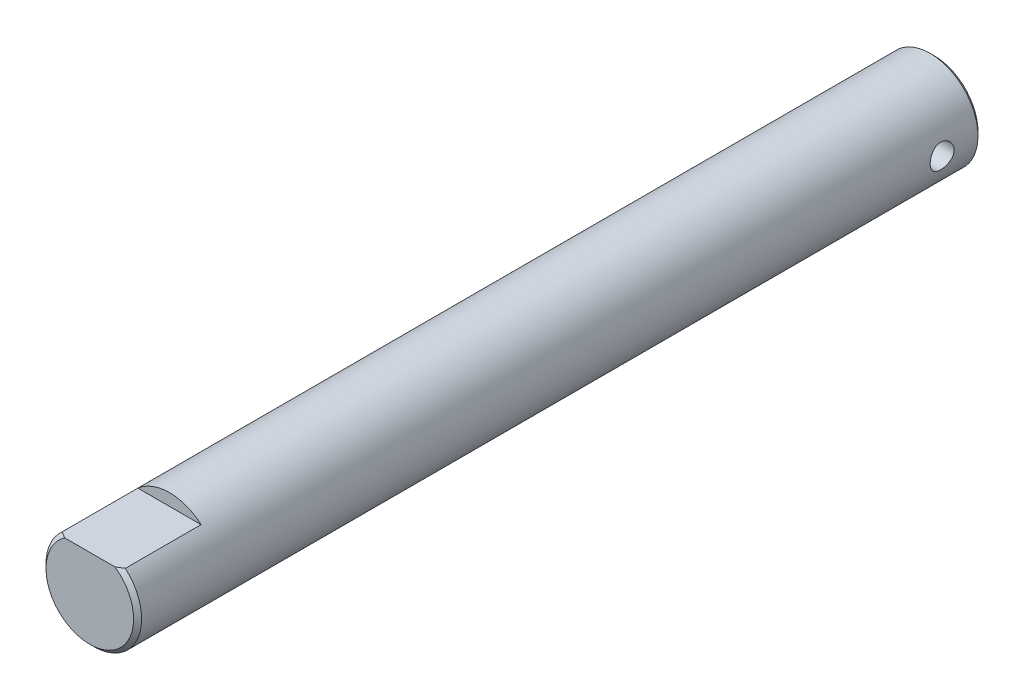
ISO-10303-21;
HEADER;
FILE_DESCRIPTION(('STEP AP214'),'2;1');
FILE_NAME('part.step','',(''),(''),'','','');
FILE_SCHEMA(('AUTOMOTIVE_DESIGN { 1 0 10303 214 1 1 1 1 }'));
ENDSEC;
DATA;
#1=APPLICATION_CONTEXT('core data for automotive mechanical design processes');
#2=APPLICATION_PROTOCOL_DEFINITION('international standard','automotive_design',2000,#1);
#3=PRODUCT_CONTEXT('',#1,'mechanical');
#4=PRODUCT('Part','Part','',(#3));
#5=PRODUCT_RELATED_PRODUCT_CATEGORY('part','',(#4));
#6=PRODUCT_DEFINITION_FORMATION('','',#4);
#7=PRODUCT_DEFINITION_CONTEXT('part definition',#1,'design');
#8=PRODUCT_DEFINITION('design','',#6,#7);
#9=PRODUCT_DEFINITION_SHAPE('','',#8);
#10=(LENGTH_UNIT() NAMED_UNIT(*) SI_UNIT(.MILLI.,.METRE.));
#11=(NAMED_UNIT(*) PLANE_ANGLE_UNIT() SI_UNIT($,.RADIAN.));
#12=(NAMED_UNIT(*) SI_UNIT($,.STERADIAN.) SOLID_ANGLE_UNIT());
#13=UNCERTAINTY_MEASURE_WITH_UNIT(LENGTH_MEASURE(1.E-05),#10,'distance_accuracy_value','');
#14=(GEOMETRIC_REPRESENTATION_CONTEXT(3) GLOBAL_UNCERTAINTY_ASSIGNED_CONTEXT((#13)) GLOBAL_UNIT_ASSIGNED_CONTEXT((#10,
#11,#12)) REPRESENTATION_CONTEXT('',''));
#15=CARTESIAN_POINT('',(0.,0.,0.));
#16=DIRECTION('',(0.,0.,1.));
#17=DIRECTION('',(1.,0.,0.));
#18=AXIS2_PLACEMENT_3D('',#15,#16,#17);
#19=CARTESIAN_POINT('',(0.,0.,53.));
#20=DIRECTION('',(0.,0.,-1.));
#21=DIRECTION('',(-1.,0.,0.));
#22=AXIS2_PLACEMENT_3D('',#19,#20,#21);
#23=CYLINDRICAL_SURFACE('',#22,6.);
#24=CARTESIAN_POINT('',(0.,0.,52.5));
#25=DIRECTION('',(0.,0.,1.));
#26=DIRECTION('',(1.,0.,0.));
#27=AXIS2_PLACEMENT_3D('',#24,#25,#26);
#28=CIRCLE('',#27,6.);
#29=CARTESIAN_POINT('',(3.96862696659689,4.5,52.5));
#30=VERTEX_POINT('',#29);
#31=CARTESIAN_POINT('',(-3.96862696659689,4.5,52.5));
#32=VERTEX_POINT('',#31);
#33=EDGE_CURVE('E105',#30,#32,#28,.F.);
#34=ORIENTED_EDGE('',*,*,#33,.T.);
#35=DIRECTION('',(0.,0.,1.));
#36=VECTOR('',#35,1.);
#37=CARTESIAN_POINT('',(-3.96862696659689,4.5,43.));
#38=LINE('',#37,#36);
#39=CARTESIAN_POINT('',(-3.96862696659689,4.5,43.));
#40=VERTEX_POINT('',#39);
#41=EDGE_CURVE('E97',#40,#32,#38,.T.);
#42=ORIENTED_EDGE('',*,*,#41,.F.);
#43=CARTESIAN_POINT('',(0.,0.,43.));
#44=DIRECTION('',(0.,0.,1.));
#45=DIRECTION('',(1.,0.,0.));
#46=AXIS2_PLACEMENT_3D('',#43,#44,#45);
#47=CIRCLE('',#46,6.);
#48=CARTESIAN_POINT('',(3.96862696659689,4.5,43.));
#49=VERTEX_POINT('',#48);
#50=EDGE_CURVE('E88',#49,#40,#47,.T.);
#51=ORIENTED_EDGE('',*,*,#50,.F.);
#52=DIRECTION('',(0.,0.,1.));
#53=VECTOR('',#52,1.);
#54=CARTESIAN_POINT('',(3.96862696659689,4.5,43.));
#55=LINE('',#54,#53);
#56=EDGE_CURVE('E99',#49,#30,#55,.T.);
#57=ORIENTED_EDGE('',*,*,#56,.T.);
#58=EDGE_LOOP('',(#34,#42,#51,#57));
#59=FACE_BOUND('',#58,.T.);
#60=CARTESIAN_POINT('',(0.,0.,-52.5));
#61=DIRECTION('',(0.,0.,1.));
#62=DIRECTION('',(1.,0.,0.));
#63=AXIS2_PLACEMENT_3D('',#60,#61,#62);
#64=CIRCLE('',#63,6.);
#65=CARTESIAN_POINT('',(6.,0.,-52.5));
#66=VERTEX_POINT('',#65);
#67=EDGE_CURVE('E168',#66,#66,#64,.T.);
#68=ORIENTED_EDGE('',*,*,#67,.T.);
#69=EDGE_LOOP('',(#68));
#70=FACE_BOUND('',#69,.T.);
#71=CARTESIAN_POINT('',(6.,0.,-46.5));
#72=CARTESIAN_POINT('',(5.99999859868013,0.0828760886697312,-46.5000023257382));
#73=CARTESIAN_POINT('',(5.99826578131828,0.165778157830763,-46.5068915507738));
#74=CARTESIAN_POINT('',(5.99152113829892,0.329206323770533,-46.534225151307));
#75=CARTESIAN_POINT('',(5.98650745419968,0.40973104687074,-46.5546772095379));
#76=CARTESIAN_POINT('',(5.9737562633204,0.566020872182577,-46.6084392534621));
#77=CARTESIAN_POINT('',(5.96602202842087,0.641791563430002,-46.6417337987153));
#78=CARTESIAN_POINT('',(5.94865343807593,0.786672131904427,-46.7201813900448));
#79=CARTESIAN_POINT('',(5.9390190185405,0.855781784348762,-46.7653348361189));
#80=CARTESIAN_POINT('',(5.91867413591801,0.986801927300924,-46.8672007896542));
#81=CARTESIAN_POINT('',(5.90794707148533,1.04855569006108,-46.9241115749592));
#82=CARTESIAN_POINT('',(5.8867362011753,1.16174892720331,-47.0474522049089));
#83=CARTESIAN_POINT('',(5.87625242288348,1.21318723694914,-47.1138831229465));
#84=CARTESIAN_POINT('',(5.8565477569971,1.30502654279904,-47.2555952267374));
#85=CARTESIAN_POINT('',(5.84734794470605,1.34525221592536,-47.3309932308104));
#86=CARTESIAN_POINT('',(5.83149494812223,1.41239690855053,-47.4877484116584));
#87=CARTESIAN_POINT('',(5.82484135672789,1.43931805543934,-47.5691046333258));
#88=CARTESIAN_POINT('',(5.81500476717551,1.47855483680429,-47.7337434982025));
#89=CARTESIAN_POINT('',(5.81175491075426,1.49115226833334,-47.8169548960498));
#90=CARTESIAN_POINT('',(5.80889362537741,1.50226177506786,-47.984368569014));
#91=CARTESIAN_POINT('',(5.80928160448644,1.50077614181798,-48.0685706806986));
#92=CARTESIAN_POINT('',(5.81359205496618,1.48398652463928,-48.2334158077445));
#93=CARTESIAN_POINT('',(5.81742863001879,1.46901834019052,-48.3140956214651));
#94=CARTESIAN_POINT('',(5.82806709676484,1.42622418690311,-48.4717610509113));
#95=CARTESIAN_POINT('',(5.83486919970696,1.39839730206943,-48.548746403029));
#96=CARTESIAN_POINT('',(5.85075113904186,1.33038947793716,-48.6977380162521));
#97=CARTESIAN_POINT('',(5.85985327469421,1.29008666723292,-48.7696861717895));
#98=CARTESIAN_POINT('',(5.87929710846386,1.19835627601496,-48.9059187097568));
#99=CARTESIAN_POINT('',(5.88963902334735,1.14692674880884,-48.9702017480673));
#100=CARTESIAN_POINT('',(5.91075880539781,1.03266342468122,-49.0912036156944));
#101=CARTESIAN_POINT('',(5.92154069477971,0.969546258165861,-49.1476544900613));
#102=CARTESIAN_POINT('',(5.94205965578786,0.834611917503703,-49.2492212424639));
#103=CARTESIAN_POINT('',(5.95179669549415,0.762794477707949,-49.2943367742636));
#104=CARTESIAN_POINT('',(5.96917732094182,0.612115888681399,-49.3720505862244));
#105=CARTESIAN_POINT('',(5.97681360127725,0.53323139320863,-49.4046053402544));
#106=CARTESIAN_POINT('',(5.98907916991419,0.370876008142888,-49.4559173057096));
#107=CARTESIAN_POINT('',(5.99370903339281,0.287405999150488,-49.4746771564181));
#108=CARTESIAN_POINT('',(5.99935499271375,0.120539970390028,-49.4974575655588));
#109=CARTESIAN_POINT('',(6.00046053508279,0.0371967199882107,-49.5018430260753));
#110=CARTESIAN_POINT('',(5.99918804814451,-0.129032874801508,-49.4967509979445));
#111=CARTESIAN_POINT('',(5.99681033241847,-0.211919259644594,-49.4872747572009));
#112=CARTESIAN_POINT('',(5.98889581127357,-0.373614268776492,-49.4550290916086));
#113=CARTESIAN_POINT('',(5.98340634185811,-0.452465118968755,-49.432458736523));
#114=CARTESIAN_POINT('',(5.96988706634134,-0.605257292452512,-49.3748929159716));
#115=CARTESIAN_POINT('',(5.96185700369892,-0.679198119032636,-49.3398961956868));
#116=CARTESIAN_POINT('',(5.9439330792631,-0.821523134429848,-49.2577638711253));
#117=CARTESIAN_POINT('',(5.93400867366932,-0.889785441835831,-49.2104238876032));
#118=CARTESIAN_POINT('',(5.91344509187419,-1.01752661364325,-49.105210091203));
#119=CARTESIAN_POINT('',(5.90280579251705,-1.07700395897301,-49.0473344603831));
#120=CARTESIAN_POINT('',(5.88168956960771,-1.18699056807274,-48.9209980391555));
#121=CARTESIAN_POINT('',(5.87122304187281,-1.23724386762204,-48.8523122969976));
#122=CARTESIAN_POINT('',(5.85192878377239,-1.3255107590127,-48.7072673655343));
#123=CARTESIAN_POINT('',(5.84310098067026,-1.36352489415794,-48.6309085170402));
#124=CARTESIAN_POINT('',(5.82818094734665,-1.4259514206093,-48.4730942775869));
#125=CARTESIAN_POINT('',(5.82207255291906,-1.45044439665407,-48.391672371656));
#126=CARTESIAN_POINT('',(5.81326744090183,-1.48534565995378,-48.2256903621109));
#127=CARTESIAN_POINT('',(5.81056997719936,-1.49575702747866,-48.1411309489675));
#128=CARTESIAN_POINT('',(5.80894901203957,-1.502038590334,-47.9738789761448));
#129=CARTESIAN_POINT('',(5.80991932728264,-1.49831789778012,-47.8912025648753));
#130=CARTESIAN_POINT('',(5.81527909007843,-1.47737727831287,-47.727696111332));
#131=CARTESIAN_POINT('',(5.81966846891857,-1.46015762268677,-47.6468660319864));
#132=CARTESIAN_POINT('',(5.83131260682722,-1.4129313194428,-47.4897915409346));
#133=CARTESIAN_POINT('',(5.83855015236309,-1.38300140468038,-47.4135226947598));
#134=CARTESIAN_POINT('',(5.85507755724828,-1.31126491360508,-47.2670346172863));
#135=CARTESIAN_POINT('',(5.86436770120773,-1.26945669003419,-47.1968162268131));
#136=CARTESIAN_POINT('',(5.88425634263512,-1.17386774863714,-47.062445370998));
#137=CARTESIAN_POINT('',(5.89488264831757,-1.11980316291226,-46.998498926576));
#138=CARTESIAN_POINT('',(5.91608027246286,-1.00178937118974,-46.8804529552046));
#139=CARTESIAN_POINT('',(5.9266515772706,-0.937837821261149,-46.826355769887));
#140=CARTESIAN_POINT('',(5.94677655647663,-0.80046758670259,-46.7285886914354));
#141=CARTESIAN_POINT('',(5.95630833365868,-0.726898422316386,-46.6851253863284));
#142=CARTESIAN_POINT('',(5.97304924975118,-0.573266059510476,-46.6112525370595));
#143=CARTESIAN_POINT('',(5.98026005199781,-0.493207563436741,-46.5808336393515));
#144=CARTESIAN_POINT('',(5.99048059565542,-0.344410253243474,-46.5384281696703));
#145=CARTESIAN_POINT('',(5.99402585052691,-0.27638017090807,-46.5240487569466));
#146=CARTESIAN_POINT('',(5.99878605231948,-0.138906071536284,-46.5048340563781));
#147=CARTESIAN_POINT('',(6.00000117450894,-0.0694621612426168,-46.4999980506947));
#148=CARTESIAN_POINT('',(6.,0.,-46.5));
#149=B_SPLINE_CURVE_WITH_KNOTS('',3,(#71,#72,#73,#74,#75,#76,#77,#78,#79,#80,#81,#82,#83,#84,
#85,#86,#87,#88,#89,#90,#91,#92,#93,#94,#95,#96,#97,#98,#99,#100,#101,#102,#103,#104,#105,#106,
#107,#108,#109,#110,#111,#112,#113,#114,#115,#116,#117,#118,#119,#120,#121,#122,#123,#124,#125,
#126,#127,#128,#129,#130,#131,#132,#133,#134,#135,#136,#137,#138,#139,#140,#141,#142,#143,#144,
#145,#146,#147,#148),.UNSPECIFIED.,.T.,.F.,(4,2,2,2,2,2,2,2,2,2,2,2,2,2,2,2,2,2,2,2,2,2,2,2,2,2,
2,2,2,2,2,2,2,2,2,2,2,2,4),(0.,0.24837371247189,0.496888237763901,0.745104902286104,
0.99332994016933,1.24614435437139,1.49898729580062,1.75558647545808,2.01214461169369,
2.2635629509943,2.51494038112697,2.76022497007018,3.00552703466038,3.25330527873879,
3.50112690836164,3.7560150096902,4.01091089558247,4.26668229009114,4.52240473688644,
4.77158308949277,5.02073901112744,5.26620274514038,5.51169127322291,5.76153587565353,
6.0114236300802,6.26744509204478,6.5234551874951,6.77792254614039,7.0323342325241,
7.27943780398614,7.52653640956036,7.77216400559449,8.01782568136902,8.26989576409912,
8.5220256977042,8.7787218549959,9.03523363821352,9.24342242942151,9.45159556043042),.UNSPECIFIED.);
#150=CARTESIAN_POINT('',(6.,0.,-46.5));
#151=VERTEX_POINT('',#150);
#152=EDGE_CURVE('E123',#151,#151,#149,.T.);
#153=ORIENTED_EDGE('',*,*,#152,.T.);
#154=EDGE_LOOP('',(#153));
#155=FACE_BOUND('',#154,.T.);
#156=CARTESIAN_POINT('',(-6.,0.,-49.5));
#157=CARTESIAN_POINT('',(-5.99999859868013,-0.0828760886697312,-49.4999976742618));
#158=CARTESIAN_POINT('',(-5.99826578131828,-0.165778157830763,-49.4931084492262));
#159=CARTESIAN_POINT('',(-5.99152113829892,-0.329206323770533,-49.465774848693));
#160=CARTESIAN_POINT('',(-5.98650745419968,-0.40973104687074,-49.4453227904622));
#161=CARTESIAN_POINT('',(-5.9737562633204,-0.566020872182577,-49.3915607465379));
#162=CARTESIAN_POINT('',(-5.96602202842087,-0.641791563430002,-49.3582662012847));
#163=CARTESIAN_POINT('',(-5.94865343807593,-0.786672131904427,-49.2798186099552));
#164=CARTESIAN_POINT('',(-5.9390190185405,-0.855781784348761,-49.2346651638811));
#165=CARTESIAN_POINT('',(-5.91867413591801,-0.986801927300925,-49.1327992103458));
#166=CARTESIAN_POINT('',(-5.90794707148533,-1.04855569006108,-49.0758884250408));
#167=CARTESIAN_POINT('',(-5.88673620117529,-1.16174892720331,-48.9525477950911));
#168=CARTESIAN_POINT('',(-5.87625242288348,-1.21318723694914,-48.8861168770535));
#169=CARTESIAN_POINT('',(-5.8565477569971,-1.30502654279904,-48.7444047732626));
#170=CARTESIAN_POINT('',(-5.84734794470605,-1.34525221592536,-48.6690067691896));
#171=CARTESIAN_POINT('',(-5.83149494812223,-1.41239690855053,-48.5122515883416));
#172=CARTESIAN_POINT('',(-5.82484135672789,-1.43931805543934,-48.4308953666742));
#173=CARTESIAN_POINT('',(-5.81500476717551,-1.47855483680429,-48.2662565017975));
#174=CARTESIAN_POINT('',(-5.81175491075426,-1.49115226833334,-48.1830451039502));
#175=CARTESIAN_POINT('',(-5.80889362537741,-1.50226177506786,-48.015631430986));
#176=CARTESIAN_POINT('',(-5.80928160448644,-1.50077614181798,-47.9314293193014));
#177=CARTESIAN_POINT('',(-5.81359205496618,-1.48398652463928,-47.7665841922555));
#178=CARTESIAN_POINT('',(-5.81742863001879,-1.46901834019052,-47.6859043785349));
#179=CARTESIAN_POINT('',(-5.82806709676484,-1.42622418690311,-47.5282389490887));
#180=CARTESIAN_POINT('',(-5.83486919970696,-1.39839730206943,-47.451253596971));
#181=CARTESIAN_POINT('',(-5.85075113904186,-1.33038947793716,-47.3022619837479));
#182=CARTESIAN_POINT('',(-5.85985327469421,-1.29008666723292,-47.2303138282105));
#183=CARTESIAN_POINT('',(-5.87929710846386,-1.19835627601496,-47.0940812902432));
#184=CARTESIAN_POINT('',(-5.88963902334735,-1.14692674880884,-47.0297982519327));
#185=CARTESIAN_POINT('',(-5.91075880539781,-1.03266342468122,-46.9087963843056));
#186=CARTESIAN_POINT('',(-5.92154069477971,-0.969546258165861,-46.8523455099387));
#187=CARTESIAN_POINT('',(-5.94205965578786,-0.834611917503703,-46.7507787575361));
#188=CARTESIAN_POINT('',(-5.95179669549415,-0.762794477707949,-46.7056632257364));
#189=CARTESIAN_POINT('',(-5.96917732094182,-0.612115888681399,-46.6279494137756));
#190=CARTESIAN_POINT('',(-5.97681360127725,-0.53323139320863,-46.5953946597456));
#191=CARTESIAN_POINT('',(-5.98907916991419,-0.370876008142888,-46.5440826942904));
#192=CARTESIAN_POINT('',(-5.99370903339281,-0.287405999150488,-46.5253228435819));
#193=CARTESIAN_POINT('',(-5.99935499271375,-0.120539970390028,-46.5025424344412));
#194=CARTESIAN_POINT('',(-6.00046053508279,-0.0371967199882107,-46.4981569739247));
#195=CARTESIAN_POINT('',(-5.99918804814451,0.129032874801507,-46.5032490020555));
#196=CARTESIAN_POINT('',(-5.99681033241847,0.211919259644594,-46.5127252427991));
#197=CARTESIAN_POINT('',(-5.98889581127357,0.373614268776493,-46.5449709083914));
#198=CARTESIAN_POINT('',(-5.98340634185811,0.452465118968757,-46.567541263477));
#199=CARTESIAN_POINT('',(-5.96988706634134,0.605257292452514,-46.6251070840284));
#200=CARTESIAN_POINT('',(-5.96185700369892,0.679198119032636,-46.6601038043132));
#201=CARTESIAN_POINT('',(-5.9439330792631,0.821523134429848,-46.7422361288747));
#202=CARTESIAN_POINT('',(-5.93400867366932,0.889785441835831,-46.7895761123968));
#203=CARTESIAN_POINT('',(-5.91344509187419,1.01752661364325,-46.894789908797));
#204=CARTESIAN_POINT('',(-5.90280579251705,1.07700395897301,-46.9526655396169));
#205=CARTESIAN_POINT('',(-5.88168956960771,1.18699056807273,-47.0790019608445));
#206=CARTESIAN_POINT('',(-5.87122304187281,1.23724386762204,-47.1476877030024));
#207=CARTESIAN_POINT('',(-5.85192878377239,1.3255107590127,-47.2927326344657));
#208=CARTESIAN_POINT('',(-5.84310098067026,1.36352489415794,-47.3690914829598));
#209=CARTESIAN_POINT('',(-5.82818094734665,1.4259514206093,-47.5269057224131));
#210=CARTESIAN_POINT('',(-5.82207255291906,1.45044439665407,-47.608327628344));
#211=CARTESIAN_POINT('',(-5.81326744090183,1.48534565995378,-47.7743096378891));
#212=CARTESIAN_POINT('',(-5.81056997719936,1.49575702747866,-47.8588690510325));
#213=CARTESIAN_POINT('',(-5.80894901203957,1.502038590334,-48.0261210238552));
#214=CARTESIAN_POINT('',(-5.80991932728264,1.49831789778012,-48.1087974351247));
#215=CARTESIAN_POINT('',(-5.81527909007843,1.47737727831287,-48.272303888668));
#216=CARTESIAN_POINT('',(-5.81966846891857,1.46015762268677,-48.3531339680137));
#217=CARTESIAN_POINT('',(-5.83131260682722,1.4129313194428,-48.5102084590654));
#218=CARTESIAN_POINT('',(-5.83855015236309,1.38300140468038,-48.5864773052402));
#219=CARTESIAN_POINT('',(-5.85507755724828,1.31126491360508,-48.7329653827137));
#220=CARTESIAN_POINT('',(-5.86436770120773,1.26945669003419,-48.8031837731869));
#221=CARTESIAN_POINT('',(-5.88425634263512,1.17386774863714,-48.937554629002));
#222=CARTESIAN_POINT('',(-5.89488264831757,1.11980316291226,-49.001501073424));
#223=CARTESIAN_POINT('',(-5.91608027246286,1.00178937118974,-49.1195470447954));
#224=CARTESIAN_POINT('',(-5.9266515772706,0.937837821261149,-49.173644230113));
#225=CARTESIAN_POINT('',(-5.94677655647663,0.80046758670259,-49.2714113085646));
#226=CARTESIAN_POINT('',(-5.95630833365868,0.726898422316386,-49.3148746136716));
#227=CARTESIAN_POINT('',(-5.97304924975118,0.573266059510476,-49.3887474629405));
#228=CARTESIAN_POINT('',(-5.98026005199781,0.493207563436741,-49.4191663606485));
#229=CARTESIAN_POINT('',(-5.99048059565542,0.344410253243474,-49.4615718303297));
#230=CARTESIAN_POINT('',(-5.99402585052691,0.27638017090807,-49.4759512430534));
#231=CARTESIAN_POINT('',(-5.99878605231948,0.138906071536284,-49.4951659436219));
#232=CARTESIAN_POINT('',(-6.00000117450894,0.0694621612426168,-49.5000019493053));
#233=CARTESIAN_POINT('',(-6.,0.,-49.5));
#234=B_SPLINE_CURVE_WITH_KNOTS('',3,(#156,#157,#158,#159,#160,#161,#162,#163,#164,#165,#166,
#167,#168,#169,#170,#171,#172,#173,#174,#175,#176,#177,#178,#179,#180,#181,#182,#183,#184,#185,
#186,#187,#188,#189,#190,#191,#192,#193,#194,#195,#196,#197,#198,#199,#200,#201,#202,#203,#204,
#205,#206,#207,#208,#209,#210,#211,#212,#213,#214,#215,#216,#217,#218,#219,#220,#221,#222,#223,
#224,#225,#226,#227,#228,#229,#230,#231,#232,#233),.UNSPECIFIED.,.T.,.F.,(4,2,2,2,2,2,2,2,2,2,2,
2,2,2,2,2,2,2,2,2,2,2,2,2,2,2,2,2,2,2,2,2,2,2,2,2,2,2,4),(0.,0.24837371247189,0.496888237763901,
0.745104902286104,0.99332994016933,1.2461443543714,1.49898729580062,1.75558647545807,
2.01214461169369,2.2635629509943,2.51494038112697,2.76022497007018,3.00552703466038,
3.25330527873879,3.50112690836164,3.7560150096902,4.01091089558247,4.26668229009114,
4.52240473688644,4.77158308949277,5.02073901112744,5.26620274514039,5.51169127322292,
5.76153587565353,6.0114236300802,6.26744509204477,6.5234551874951,6.77792254614039,
7.0323342325241,7.27943780398614,7.52653640956036,7.77216400559449,8.01782568136903,
8.26989576409912,8.5220256977042,8.7787218549959,9.03523363821352,9.24342242942151,
9.45159556043042),.UNSPECIFIED.);
#235=CARTESIAN_POINT('',(-6.,0.,-49.5));
#236=VERTEX_POINT('',#235);
#237=EDGE_CURVE('E111',#236,#236,#234,.T.);
#238=ORIENTED_EDGE('',*,*,#237,.F.);
#239=EDGE_LOOP('',(#238));
#240=FACE_BOUND('',#239,.T.);
#241=ADVANCED_FACE('F49',(#59,#70,#155,#240),#23,.T.);
#242=CARTESIAN_POINT('',(0.,0.,53.));
#243=DIRECTION('',(0.,0.,1.));
#244=DIRECTION('',(1.,0.,0.));
#245=AXIS2_PLACEMENT_3D('',#242,#243,#244);
#246=PLANE('',#245);
#247=DIRECTION('',(1.,0.,0.));
#248=VECTOR('',#247,1.);
#249=CARTESIAN_POINT('',(-3.96862696659689,4.5,53.));
#250=LINE('',#249,#248);
#251=CARTESIAN_POINT('',(-3.16227766016844,4.5,53.));
#252=VERTEX_POINT('',#251);
#253=CARTESIAN_POINT('',(3.16227766016844,4.5,53.));
#254=VERTEX_POINT('',#253);
#255=EDGE_CURVE('E71',#252,#254,#250,.T.);
#256=ORIENTED_EDGE('',*,*,#255,.F.);
#257=CARTESIAN_POINT('',(0.,0.,53.));
#258=DIRECTION('',(0.,0.,1.));
#259=DIRECTION('',(1.,0.,0.));
#260=AXIS2_PLACEMENT_3D('',#257,#258,#259);
#261=CIRCLE('',#260,5.50000000000003);
#262=EDGE_CURVE('E175',#252,#254,#261,.T.);
#263=ORIENTED_EDGE('',*,*,#262,.T.);
#264=EDGE_LOOP('',(#256,#263));
#265=FACE_BOUND('',#264,.T.);
#266=ADVANCED_FACE('F139',(#265),#246,.T.);
#267=CARTESIAN_POINT('',(0.,0.,-53.));
#268=DIRECTION('',(0.,0.,1.));
#269=DIRECTION('',(1.,0.,0.));
#270=AXIS2_PLACEMENT_3D('',#267,#268,#269);
#271=PLANE('',#270);
#272=CARTESIAN_POINT('',(0.,0.,-53.));
#273=DIRECTION('',(0.,0.,1.));
#274=DIRECTION('',(1.,0.,0.));
#275=AXIS2_PLACEMENT_3D('',#272,#273,#274);
#276=CIRCLE('',#275,5.50000000000003);
#277=CARTESIAN_POINT('',(5.50000000000003,0.,-53.));
#278=VERTEX_POINT('',#277);
#279=EDGE_CURVE('E165',#278,#278,#276,.F.);
#280=ORIENTED_EDGE('',*,*,#279,.T.);
#281=EDGE_LOOP('',(#280));
#282=FACE_BOUND('',#281,.T.);
#283=ADVANCED_FACE('F145',(#282),#271,.F.);
#284=CARTESIAN_POINT('',(6.001,0.,-48.));
#285=DIRECTION('',(-1.,0.,0.));
#286=DIRECTION('',(0.,0.,1.));
#287=AXIS2_PLACEMENT_3D('',#284,#285,#286);
#288=CYLINDRICAL_SURFACE('',#287,1.5);
#289=ORIENTED_EDGE('',*,*,#152,.F.);
#290=EDGE_LOOP('',(#289));
#291=FACE_BOUND('',#290,.T.);
#292=ORIENTED_EDGE('',*,*,#237,.T.);
#293=EDGE_LOOP('',(#292));
#294=FACE_BOUND('',#293,.T.);
#295=ADVANCED_FACE('F153',(#291,#294),#288,.F.);
#296=CARTESIAN_POINT('',(0.,0.,-52.5));
#297=DIRECTION('',(0.,0.,1.));
#298=DIRECTION('',(1.,0.,0.));
#299=AXIS2_PLACEMENT_3D('',#296,#297,#298);
#300=CONICAL_SURFACE('',#299,6.,0.785398163397444);
#301=ORIENTED_EDGE('',*,*,#279,.F.);
#302=EDGE_LOOP('',(#301));
#303=FACE_BOUND('',#302,.T.);
#304=ORIENTED_EDGE('',*,*,#67,.F.);
#305=EDGE_LOOP('',(#304));
#306=FACE_BOUND('',#305,.T.);
#307=ADVANCED_FACE('F150',(#303,#306),#300,.T.);
#308=CARTESIAN_POINT('',(0.,0.,53.));
#309=DIRECTION('',(0.,0.,-1.));
#310=DIRECTION('',(-1.,0.,0.));
#311=AXIS2_PLACEMENT_3D('',#308,#309,#310);
#312=CONICAL_SURFACE('',#311,5.50000000000003,0.785398163397451);
#313=CARTESIAN_POINT('',(-3.96932696659689,4.5,52.4995369705536));
#314=CARTESIAN_POINT('',(-3.87304468080124,4.5,52.5632169643785));
#315=CARTESIAN_POINT('',(-3.77616677963268,4.5,52.6260093176112));
#316=CARTESIAN_POINT('',(-3.58105421371582,4.5,52.7495035658277));
#317=CARTESIAN_POINT('',(-3.48281920638923,4.5,52.8102049189476));
#318=CARTESIAN_POINT('',(-3.28435670942016,4.5,52.9294811534401));
#319=CARTESIAN_POINT('',(-3.18412146711252,4.5,52.988043198516));
#320=CARTESIAN_POINT('',(-2.98202395687161,4.5,53.1022661831645));
#321=CARTESIAN_POINT('',(-2.88016179697021,4.5,53.1579273143281));
#322=CARTESIAN_POINT('',(-2.56593845022974,4.5,53.3229788135237));
#323=CARTESIAN_POINT('',(-2.35065762326782,4.5,53.4269294681436));
#324=CARTESIAN_POINT('',(-1.91178963009906,4.5,53.6147345338982));
#325=CARTESIAN_POINT('',(-1.6882215131673,4.5,53.6986320873114));
#326=CARTESIAN_POINT('',(-1.32675449953204,4.5,53.810211211472));
#327=CARTESIAN_POINT('',(-1.19160817038663,4.5,53.8467996394164));
#328=CARTESIAN_POINT('',(-0.918779289775629,4.5,53.9090814068741));
#329=CARTESIAN_POINT('',(-0.781096659649087,4.5,53.9347744078806));
#330=CARTESIAN_POINT('',(-0.505636653206499,4.5,53.9737086872283));
#331=CARTESIAN_POINT('',(-0.367880082452009,4.5,53.987095136308));
#332=CARTESIAN_POINT('',(-0.0917179384168567,4.5,54.0011774854638));
#333=CARTESIAN_POINT('',(0.0466875864947491,4.5,54.0018743167663));
#334=CARTESIAN_POINT('',(0.323056405426837,4.5,53.9905338516377));
#335=CARTESIAN_POINT('',(0.461019356248075,4.5,53.9784883336063));
#336=CARTESIAN_POINT('',(0.73534682252479,4.5,53.9423436411936));
#337=CARTESIAN_POINT('',(0.871711150880722,4.5,53.9182430700466));
#338=CARTESIAN_POINT('',(1.14363504409316,4.5,53.8588713990268));
#339=CARTESIAN_POINT('',(1.27916627855488,4.5,53.8234722469224));
#340=CARTESIAN_POINT('',(1.54732673165483,4.5,53.7431263126755));
#341=CARTESIAN_POINT('',(1.67995595792776,4.5,53.6981795556544));
#342=CARTESIAN_POINT('',(2.00503677734374,4.5,53.5768140068095));
#343=CARTESIAN_POINT('',(2.19570476391982,4.5,53.4956341074673));
#344=CARTESIAN_POINT('',(2.57094921629759,4.5,53.3200156387838));
#345=CARTESIAN_POINT('',(2.75551893256847,4.5,53.225562948819));
#346=CARTESIAN_POINT('',(3.11423723719973,4.5,53.0294838372625));
#347=CARTESIAN_POINT('',(3.28853277390238,4.5,52.9281239999135));
#348=CARTESIAN_POINT('',(3.54644873116852,4.5,52.7708911221641));
#349=CARTESIAN_POINT('',(3.63171950801598,4.5,52.7176903310002));
#350=CARTESIAN_POINT('',(3.80125224186777,4.5,52.6097320174959));
#351=CARTESIAN_POINT('',(3.88551435188692,4.5,52.5549747356396));
#352=CARTESIAN_POINT('',(3.96932696659689,4.5,52.4995369705536));
#353=B_SPLINE_CURVE_WITH_KNOTS('',3,(#313,#314,#315,#316,#317,#318,#319,#320,#321,#322,#323,
#324,#325,#326,#327,#328,#329,#330,#331,#332,#333,#334,#335,#336,#337,#338,#339,#340,#341,#342,
#343,#344,#345,#346,#347,#348,#349,#350,#351,#352),.UNSPECIFIED.,.F.,.F.,(4,2,2,2,2,2,2,2,2,2,2,
2,2,2,2,2,2,2,2,4),(0.,0.346312506603484,0.692714092030101,1.0409341904005,1.38913126133352,
2.10561305354154,2.82053924421131,3.24019972386057,3.65987324086364,4.07453018176245,
4.48915669297621,4.9040508921707,5.31899317446166,5.7388159553488,6.15863763161769,
6.77960344379939,7.4012349607494,8.00587846175204,8.30738313541652,8.60884147591047),.UNSPECIFIED.);
#354=EDGE_CURVE('E11',#32,#252,#353,.T.);
#355=ORIENTED_EDGE('',*,*,#354,.F.);
#356=ORIENTED_EDGE('',*,*,#33,.F.);
#357=EDGE_CURVE('E55',#254,#30,#353,.T.);
#358=ORIENTED_EDGE('',*,*,#357,.F.);
#359=ORIENTED_EDGE('',*,*,#262,.F.);
#360=EDGE_LOOP('',(#355,#356,#358,#359));
#361=FACE_BOUND('',#360,.T.);
#362=ADVANCED_FACE('F52',(#361),#312,.T.);
#363=CARTESIAN_POINT('',(-3.96862696659689,4.5,43.));
#364=DIRECTION('',(0.,-1.,0.));
#365=DIRECTION('',(0.,0.,-1.));
#366=AXIS2_PLACEMENT_3D('',#363,#364,#365);
#367=PLANE('',#366);
#368=ORIENTED_EDGE('',*,*,#354,.T.);
#369=ORIENTED_EDGE('',*,*,#255,.T.);
#370=ORIENTED_EDGE('',*,*,#357,.T.);
#371=ORIENTED_EDGE('',*,*,#56,.F.);
#372=DIRECTION('',(1.,0.,0.));
#373=VECTOR('',#372,1.);
#374=CARTESIAN_POINT('',(-3.96862696659689,4.5,43.));
#375=LINE('',#374,#373);
#376=EDGE_CURVE('E91',#40,#49,#375,.T.);
#377=ORIENTED_EDGE('',*,*,#376,.F.);
#378=ORIENTED_EDGE('',*,*,#41,.T.);
#379=EDGE_LOOP('',(#368,#369,#370,#371,#377,#378));
#380=FACE_BOUND('',#379,.T.);
#381=ADVANCED_FACE('F96',(#380),#367,.F.);
#382=CARTESIAN_POINT('',(0.,0.,43.));
#383=DIRECTION('',(0.,0.,1.));
#384=DIRECTION('',(1.,0.,0.));
#385=AXIS2_PLACEMENT_3D('',#382,#383,#384);
#386=PLANE('',#385);
#387=ORIENTED_EDGE('',*,*,#50,.T.);
#388=ORIENTED_EDGE('',*,*,#376,.T.);
#389=EDGE_LOOP('',(#387,#388));
#390=FACE_BOUND('',#389,.T.);
#391=ADVANCED_FACE('F90',(#390),#386,.T.);
#392=CLOSED_SHELL('',(#241,#266,#283,#295,#307,#362,#381,#391));
#393=MANIFOLD_SOLID_BREP('B2',#392);
#394=ADVANCED_BREP_SHAPE_REPRESENTATION('',(#18,#393),#14);
#395=SHAPE_DEFINITION_REPRESENTATION(#9,#394);
ENDSEC;
END-ISO-10303-21;
